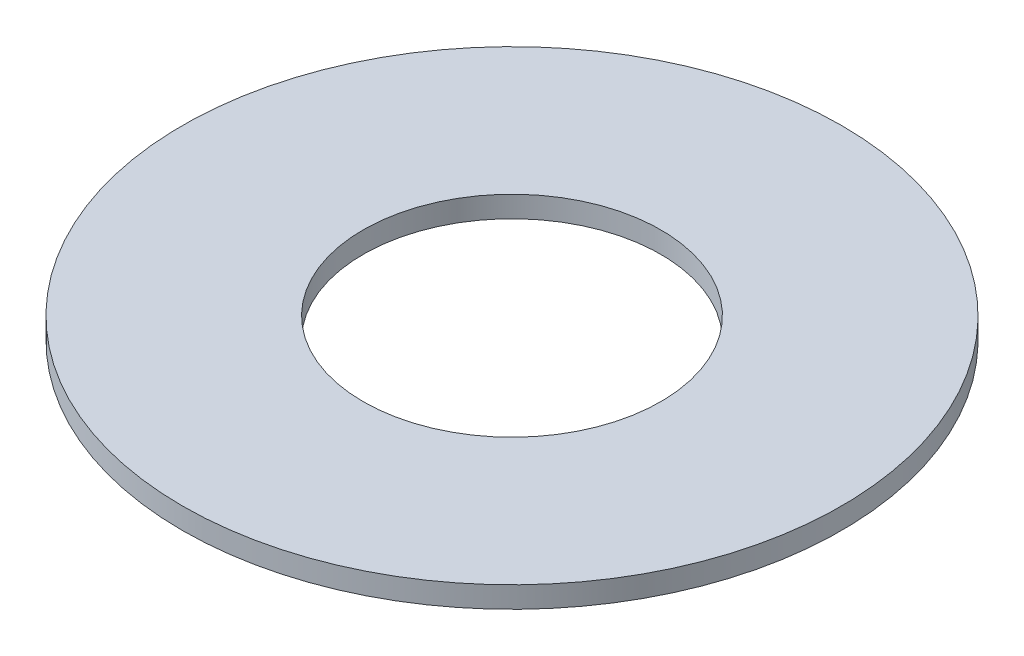
ISO-10303-21;
HEADER;
FILE_DESCRIPTION(('STEP AP214'),'2;1');
FILE_NAME('part.step','',(''),(''),'','','');
FILE_SCHEMA(('AUTOMOTIVE_DESIGN { 1 0 10303 214 1 1 1 1 }'));
ENDSEC;
DATA;
#1=APPLICATION_CONTEXT('core data for automotive mechanical design processes');
#2=APPLICATION_PROTOCOL_DEFINITION('international standard','automotive_design',2000,#1);
#3=PRODUCT_CONTEXT('',#1,'mechanical');
#4=PRODUCT('Part','Part','',(#3));
#5=PRODUCT_RELATED_PRODUCT_CATEGORY('part','',(#4));
#6=PRODUCT_DEFINITION_FORMATION('','',#4);
#7=PRODUCT_DEFINITION_CONTEXT('part definition',#1,'design');
#8=PRODUCT_DEFINITION('design','',#6,#7);
#9=PRODUCT_DEFINITION_SHAPE('','',#8);
#10=(LENGTH_UNIT() NAMED_UNIT(*) SI_UNIT(.MILLI.,.METRE.));
#11=(NAMED_UNIT(*) PLANE_ANGLE_UNIT() SI_UNIT($,.RADIAN.));
#12=(NAMED_UNIT(*) SI_UNIT($,.STERADIAN.) SOLID_ANGLE_UNIT());
#13=UNCERTAINTY_MEASURE_WITH_UNIT(LENGTH_MEASURE(1.E-05),#10,'distance_accuracy_value','');
#14=(GEOMETRIC_REPRESENTATION_CONTEXT(3) GLOBAL_UNCERTAINTY_ASSIGNED_CONTEXT((#13)) GLOBAL_UNIT_ASSIGNED_CONTEXT((#10,
#11,#12)) REPRESENTATION_CONTEXT('',''));
#15=CARTESIAN_POINT('',(0.,0.,0.));
#16=DIRECTION('',(0.,0.,1.));
#17=DIRECTION('',(1.,0.,0.));
#18=AXIS2_PLACEMENT_3D('',#15,#16,#17);
#19=CARTESIAN_POINT('',(0.,5.,0.));
#20=DIRECTION('',(0.,-1.,0.));
#21=DIRECTION('',(0.,0.,-1.));
#22=AXIS2_PLACEMENT_3D('',#19,#20,#21);
#23=CYLINDRICAL_SURFACE('',#22,77.5);
#24=CARTESIAN_POINT('',(0.,5.,0.));
#25=DIRECTION('',(0.,1.,0.));
#26=DIRECTION('',(0.,0.,1.));
#27=AXIS2_PLACEMENT_3D('',#24,#25,#26);
#28=CIRCLE('',#27,77.5);
#29=CARTESIAN_POINT('',(0.,5.,77.5));
#30=VERTEX_POINT('',#29);
#31=EDGE_CURVE('E10',#30,#30,#28,.T.);
#32=ORIENTED_EDGE('',*,*,#31,.F.);
#33=EDGE_LOOP('',(#32));
#34=FACE_BOUND('',#33,.T.);
#35=CARTESIAN_POINT('',(0.,0.,0.));
#36=DIRECTION('',(0.,1.,0.));
#37=DIRECTION('',(0.,0.,1.));
#38=AXIS2_PLACEMENT_3D('',#35,#36,#37);
#39=CIRCLE('',#38,77.5);
#40=CARTESIAN_POINT('',(0.,0.,77.5));
#41=VERTEX_POINT('',#40);
#42=EDGE_CURVE('E37',#41,#41,#39,.T.);
#43=ORIENTED_EDGE('',*,*,#42,.T.);
#44=EDGE_LOOP('',(#43));
#45=FACE_BOUND('',#44,.T.);
#46=ADVANCED_FACE('F40',(#34,#45),#23,.T.);
#47=CARTESIAN_POINT('',(0.,5.,0.));
#48=DIRECTION('',(0.,1.,0.));
#49=DIRECTION('',(0.,0.,1.));
#50=AXIS2_PLACEMENT_3D('',#47,#48,#49);
#51=PLANE('',#50);
#52=CARTESIAN_POINT('',(0.,5.,0.));
#53=DIRECTION('',(0.,1.,0.));
#54=DIRECTION('',(0.,0.,1.));
#55=AXIS2_PLACEMENT_3D('',#52,#53,#54);
#56=CIRCLE('',#55,35.);
#57=CARTESIAN_POINT('',(0.,5.,35.));
#58=VERTEX_POINT('',#57);
#59=EDGE_CURVE('E50',#58,#58,#56,.T.);
#60=ORIENTED_EDGE('',*,*,#59,.F.);
#61=EDGE_LOOP('',(#60));
#62=FACE_BOUND('',#61,.T.);
#63=ORIENTED_EDGE('',*,*,#31,.T.);
#64=EDGE_LOOP('',(#63));
#65=FACE_BOUND('',#64,.T.);
#66=ADVANCED_FACE('F59',(#62,#65),#51,.T.);
#67=CARTESIAN_POINT('',(0.,0.,0.));
#68=DIRECTION('',(0.,1.,0.));
#69=DIRECTION('',(0.,0.,1.));
#70=AXIS2_PLACEMENT_3D('',#67,#68,#69);
#71=PLANE('',#70);
#72=CARTESIAN_POINT('',(0.,0.,0.));
#73=DIRECTION('',(0.,1.,0.));
#74=DIRECTION('',(0.,0.,1.));
#75=AXIS2_PLACEMENT_3D('',#72,#73,#74);
#76=CIRCLE('',#75,35.);
#77=CARTESIAN_POINT('',(0.,0.,35.));
#78=VERTEX_POINT('',#77);
#79=EDGE_CURVE('E47',#78,#78,#76,.T.);
#80=ORIENTED_EDGE('',*,*,#79,.T.);
#81=EDGE_LOOP('',(#80));
#82=FACE_BOUND('',#81,.T.);
#83=ORIENTED_EDGE('',*,*,#42,.F.);
#84=EDGE_LOOP('',(#83));
#85=FACE_BOUND('',#84,.T.);
#86=ADVANCED_FACE('F58',(#82,#85),#71,.F.);
#87=CARTESIAN_POINT('',(0.,5.,0.));
#88=DIRECTION('',(0.,-1.,0.));
#89=DIRECTION('',(0.,0.,-1.));
#90=AXIS2_PLACEMENT_3D('',#87,#88,#89);
#91=CYLINDRICAL_SURFACE('',#90,35.);
#92=ORIENTED_EDGE('',*,*,#59,.T.);
#93=EDGE_LOOP('',(#92));
#94=FACE_BOUND('',#93,.T.);
#95=ORIENTED_EDGE('',*,*,#79,.F.);
#96=EDGE_LOOP('',(#95));
#97=FACE_BOUND('',#96,.T.);
#98=ADVANCED_FACE('F54',(#94,#97),#91,.F.);
#99=CLOSED_SHELL('',(#46,#66,#86,#98));
#100=MANIFOLD_SOLID_BREP('B2',#99);
#101=ADVANCED_BREP_SHAPE_REPRESENTATION('',(#18,#100),#14);
#102=SHAPE_DEFINITION_REPRESENTATION(#9,#101);
ENDSEC;
END-ISO-10303-21;
